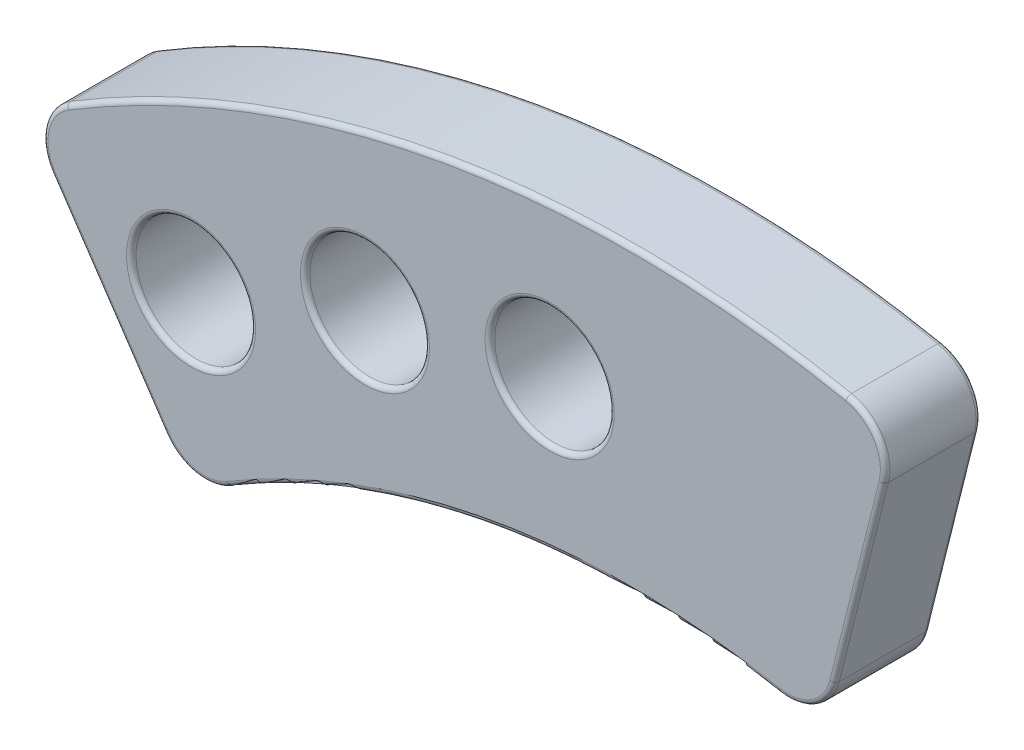
ISO-10303-21;
HEADER;
FILE_DESCRIPTION(('STEP AP214'),'2;1');
FILE_NAME('part.step','',(''),(''),'','','');
FILE_SCHEMA(('AUTOMOTIVE_DESIGN { 1 0 10303 214 1 1 1 1 }'));
ENDSEC;
DATA;
#1=APPLICATION_CONTEXT('core data for automotive mechanical design processes');
#2=APPLICATION_PROTOCOL_DEFINITION('international standard','automotive_design',2000,#1);
#3=PRODUCT_CONTEXT('',#1,'mechanical');
#4=PRODUCT('Part','Part','',(#3));
#5=PRODUCT_RELATED_PRODUCT_CATEGORY('part','',(#4));
#6=PRODUCT_DEFINITION_FORMATION('','',#4);
#7=PRODUCT_DEFINITION_CONTEXT('part definition',#1,'design');
#8=PRODUCT_DEFINITION('design','',#6,#7);
#9=PRODUCT_DEFINITION_SHAPE('','',#8);
#10=(LENGTH_UNIT() NAMED_UNIT(*) SI_UNIT(.MILLI.,.METRE.));
#11=(NAMED_UNIT(*) PLANE_ANGLE_UNIT() SI_UNIT($,.RADIAN.));
#12=(NAMED_UNIT(*) SI_UNIT($,.STERADIAN.) SOLID_ANGLE_UNIT());
#13=UNCERTAINTY_MEASURE_WITH_UNIT(LENGTH_MEASURE(1.E-05),#10,'distance_accuracy_value','');
#14=(GEOMETRIC_REPRESENTATION_CONTEXT(3) GLOBAL_UNCERTAINTY_ASSIGNED_CONTEXT((#13)) GLOBAL_UNIT_ASSIGNED_CONTEXT((#10,
#11,#12)) REPRESENTATION_CONTEXT('',''));
#15=CARTESIAN_POINT('',(0.,0.,0.));
#16=DIRECTION('',(0.,0.,1.));
#17=DIRECTION('',(1.,0.,0.));
#18=AXIS2_PLACEMENT_3D('',#15,#16,#17);
#19=CARTESIAN_POINT('',(-0.00224632428349675,0.000561633652876828,4.));
#20=DIRECTION('',(0.970137156618253,-0.242556998144047,0.));
#21=DIRECTION('',(0.242556998144047,0.970137156618253,0.));
#22=AXIS2_PLACEMENT_3D('',#19,#20,#21);
#23=PLANE('',#22);
#24=DIRECTION('',(0.,0.,1.));
#25=VECTOR('',#24,1.);
#26=CARTESIAN_POINT('',(10.5367100920138,42.1524405308287,4.));
#27=LINE('',#26,#25);
#28=CARTESIAN_POINT('',(10.5367100920138,42.1524405308287,0.2));
#29=VERTEX_POINT('',#28);
#30=CARTESIAN_POINT('',(10.5367100920138,42.1524405308287,3.8));
#31=VERTEX_POINT('',#30);
#32=EDGE_CURVE('E318',#29,#31,#27,.T.);
#33=ORIENTED_EDGE('',*,*,#32,.T.);
#34=DIRECTION('',(-0.242556998144047,-0.970137156618253,0.));
#35=VECTOR('',#34,1.);
#36=CARTESIAN_POINT('',(-0.00224632428349675,0.000561633652876828,3.8));
#37=LINE('',#36,#35);
#38=CARTESIAN_POINT('',(8.47203942693548,33.8945310757377,3.8));
#39=VERTEX_POINT('',#38);
#40=EDGE_CURVE('E195',#31,#39,#37,.T.);
#41=ORIENTED_EDGE('',*,*,#40,.T.);
#42=DIRECTION('',(0.,0.,-1.));
#43=VECTOR('',#42,1.);
#44=CARTESIAN_POINT('',(8.47203942693548,33.8945310757377,4.));
#45=LINE('',#44,#43);
#46=CARTESIAN_POINT('',(8.47203942693548,33.8945310757377,0.2));
#47=VERTEX_POINT('',#46);
#48=EDGE_CURVE('E326',#39,#47,#45,.T.);
#49=ORIENTED_EDGE('',*,*,#48,.T.);
#50=DIRECTION('',(-0.242556998144047,-0.970137156618253,0.));
#51=VECTOR('',#50,1.);
#52=CARTESIAN_POINT('',(10.5367100920138,42.1524405308287,0.2));
#53=LINE('',#52,#51);
#54=EDGE_CURVE('E193',#47,#29,#53,.F.);
#55=ORIENTED_EDGE('',*,*,#54,.T.);
#56=EDGE_LOOP('',(#33,#41,#49,#55));
#57=FACE_BOUND('',#56,.T.);
#58=ADVANCED_FACE('F37',(#57),#23,.T.);
#59=CARTESIAN_POINT('',(0.,0.,4.));
#60=DIRECTION('',(0.,0.,-1.));
#61=DIRECTION('',(-1.,0.,0.));
#62=AXIS2_PLACEMENT_3D('',#59,#60,#61);
#63=CYLINDRICAL_SURFACE('',#62,45.4955142991953);
#64=DIRECTION('',(0.,0.,-1.));
#65=VECTOR('',#64,1.);
#66=CARTESIAN_POINT('',(-23.6671021063968,38.8549880869068,4.));
#67=LINE('',#66,#65);
#68=CARTESIAN_POINT('',(-23.6671021063968,38.8549880869068,0.2));
#69=VERTEX_POINT('',#68);
#70=CARTESIAN_POINT('',(-23.6671021063968,38.8549880869068,3.8));
#71=VERTEX_POINT('',#70);
#72=EDGE_CURVE('E310',#69,#71,#67,.F.);
#73=ORIENTED_EDGE('',*,*,#72,.T.);
#74=CARTESIAN_POINT('',(0.,0.,3.8));
#75=DIRECTION('',(0.,0.,1.));
#76=DIRECTION('',(1.,0.,0.));
#77=AXIS2_PLACEMENT_3D('',#74,#75,#76);
#78=CIRCLE('',#77,45.4955142991953);
#79=CARTESIAN_POINT('',(8.99171496640316,44.5981040326968,3.8));
#80=VERTEX_POINT('',#79);
#81=EDGE_CURVE('E187',#71,#80,#78,.F.);
#82=ORIENTED_EDGE('',*,*,#81,.T.);
#83=DIRECTION('',(0.,0.,-1.));
#84=VECTOR('',#83,1.);
#85=CARTESIAN_POINT('',(8.99171496640316,44.5981040326968,4.));
#86=LINE('',#85,#84);
#87=CARTESIAN_POINT('',(8.99171496640316,44.5981040326968,0.2));
#88=VERTEX_POINT('',#87);
#89=EDGE_CURVE('E330',#80,#88,#86,.T.);
#90=ORIENTED_EDGE('',*,*,#89,.T.);
#91=CARTESIAN_POINT('',(0.,0.,0.2));
#92=DIRECTION('',(0.,0.,1.));
#93=DIRECTION('',(1.,0.,0.));
#94=AXIS2_PLACEMENT_3D('',#91,#92,#93);
#95=CIRCLE('',#94,45.4955142991953);
#96=EDGE_CURVE('E185',#88,#69,#95,.T.);
#97=ORIENTED_EDGE('',*,*,#96,.T.);
#98=EDGE_LOOP('',(#73,#82,#90,#97));
#99=FACE_BOUND('',#98,.T.);
#100=ADVANCED_FACE('F359',(#99),#63,.T.);
#101=CARTESIAN_POINT('',(0.,0.,4.));
#102=DIRECTION('',(0.829216596767474,0.558927397472488,0.));
#103=DIRECTION('',(-0.558927397472488,0.829216596767474,0.));
#104=AXIS2_PLACEMENT_3D('',#101,#102,#103);
#105=PLANE('',#104);
#106=DIRECTION('',(0.,0.,1.));
#107=VECTOR('',#106,1.);
#108=CARTESIAN_POINT('',(-19.5274863105358,28.9706960422225,4.));
#109=LINE('',#108,#107);
#110=CARTESIAN_POINT('',(-19.5274863105358,28.9706960422225,0.2));
#111=VERTEX_POINT('',#110);
#112=CARTESIAN_POINT('',(-19.5274863105358,28.9706960422225,3.8));
#113=VERTEX_POINT('',#112);
#114=EDGE_CURVE('E315',#111,#113,#109,.T.);
#115=ORIENTED_EDGE('',*,*,#114,.T.);
#116=DIRECTION('',(0.558927397472488,-0.829216596767474,0.));
#117=VECTOR('',#116,1.);
#118=CARTESIAN_POINT('',(-24.2851205482376,36.0290533335123,3.8));
#119=LINE('',#118,#117);
#120=CARTESIAN_POINT('',(-24.2851205482376,36.0290533335122,3.8));
#121=VERTEX_POINT('',#120);
#122=EDGE_CURVE('E212',#113,#121,#119,.F.);
#123=ORIENTED_EDGE('',*,*,#122,.T.);
#124=DIRECTION('',(0.,0.,-1.));
#125=VECTOR('',#124,1.);
#126=CARTESIAN_POINT('',(-24.2851205482376,36.0290533335122,4.));
#127=LINE('',#126,#125);
#128=CARTESIAN_POINT('',(-24.2851205482376,36.0290533335122,0.2));
#129=VERTEX_POINT('',#128);
#130=EDGE_CURVE('E308',#121,#129,#127,.T.);
#131=ORIENTED_EDGE('',*,*,#130,.T.);
#132=DIRECTION('',(0.558927397472488,-0.829216596767474,0.));
#133=VECTOR('',#132,1.);
#134=CARTESIAN_POINT('',(0.,0.,0.2));
#135=LINE('',#134,#133);
#136=EDGE_CURVE('E210',#129,#111,#135,.T.);
#137=ORIENTED_EDGE('',*,*,#136,.T.);
#138=EDGE_LOOP('',(#115,#123,#131,#137));
#139=FACE_BOUND('',#138,.T.);
#140=ADVANCED_FACE('F313',(#139),#105,.F.);
#141=CARTESIAN_POINT('',(-18.4416012545147,34.6422131416891,4.));
#142=DIRECTION('',(0.,0.,-1.));
#143=DIRECTION('',(-1.,0.,0.));
#144=AXIS2_PLACEMENT_3D('',#141,#142,#143);
#145=CYLINDRICAL_SURFACE('',#144,2.5);
#146=CARTESIAN_POINT('',(-18.4416012545147,34.6422131416891,3.8));
#147=DIRECTION('',(0.,0.,1.));
#148=DIRECTION('',(1.,0.,0.));
#149=AXIS2_PLACEMENT_3D('',#146,#147,#148);
#150=CIRCLE('',#149,2.5);
#151=CARTESIAN_POINT('',(-15.9416012545147,34.6422131416891,3.8));
#152=VERTEX_POINT('',#151);
#153=EDGE_CURVE('E217',#152,#152,#150,.T.);
#154=ORIENTED_EDGE('',*,*,#153,.T.);
#155=EDGE_LOOP('',(#154));
#156=FACE_BOUND('',#155,.T.);
#157=CARTESIAN_POINT('',(-18.4416012545147,34.6422131416891,0.2));
#158=DIRECTION('',(0.,0.,1.));
#159=DIRECTION('',(1.,0.,0.));
#160=AXIS2_PLACEMENT_3D('',#157,#158,#159);
#161=CIRCLE('',#160,2.5);
#162=CARTESIAN_POINT('',(-15.9416012545147,34.6422131416891,0.2));
#163=VERTEX_POINT('',#162);
#164=EDGE_CURVE('E214',#163,#163,#161,.F.);
#165=ORIENTED_EDGE('',*,*,#164,.T.);
#166=EDGE_LOOP('',(#165));
#167=FACE_BOUND('',#166,.T.);
#168=ADVANCED_FACE('F413',(#156,#167),#145,.F.);
#169=CARTESIAN_POINT('',(-11.1648341843668,37.6234244297405,4.));
#170=DIRECTION('',(0.,0.,-1.));
#171=DIRECTION('',(-1.,0.,0.));
#172=AXIS2_PLACEMENT_3D('',#169,#170,#171);
#173=CYLINDRICAL_SURFACE('',#172,2.5);
#174=CARTESIAN_POINT('',(-11.1648341843668,37.6234244297405,3.8));
#175=DIRECTION('',(0.,0.,1.));
#176=DIRECTION('',(1.,0.,0.));
#177=AXIS2_PLACEMENT_3D('',#174,#175,#176);
#178=CIRCLE('',#177,2.5);
#179=CARTESIAN_POINT('',(-8.66483418436678,37.6234244297405,3.8));
#180=VERTEX_POINT('',#179);
#181=EDGE_CURVE('E223',#180,#180,#178,.T.);
#182=ORIENTED_EDGE('',*,*,#181,.T.);
#183=EDGE_LOOP('',(#182));
#184=FACE_BOUND('',#183,.T.);
#185=CARTESIAN_POINT('',(-11.1648341843668,37.6234244297405,0.2));
#186=DIRECTION('',(0.,0.,1.));
#187=DIRECTION('',(1.,0.,0.));
#188=AXIS2_PLACEMENT_3D('',#185,#186,#187);
#189=CIRCLE('',#188,2.5);
#190=CARTESIAN_POINT('',(-8.66483418436678,37.6234244297405,0.2));
#191=VERTEX_POINT('',#190);
#192=EDGE_CURVE('E220',#191,#191,#189,.F.);
#193=ORIENTED_EDGE('',*,*,#192,.T.);
#194=EDGE_LOOP('',(#193));
#195=FACE_BOUND('',#194,.T.);
#196=ADVANCED_FACE('F416',(#184,#195),#173,.F.);
#197=CARTESIAN_POINT('',(-3.43979242599749,39.0940330005862,4.));
#198=DIRECTION('',(0.,0.,-1.));
#199=DIRECTION('',(-1.,0.,0.));
#200=AXIS2_PLACEMENT_3D('',#197,#198,#199);
#201=CYLINDRICAL_SURFACE('',#200,2.5);
#202=CARTESIAN_POINT('',(-3.43979242599749,39.0940330005862,3.8));
#203=DIRECTION('',(0.,0.,1.));
#204=DIRECTION('',(1.,0.,0.));
#205=AXIS2_PLACEMENT_3D('',#202,#203,#204);
#206=CIRCLE('',#205,2.5);
#207=CARTESIAN_POINT('',(-0.939792425997486,39.0940330005862,3.8));
#208=VERTEX_POINT('',#207);
#209=EDGE_CURVE('E229',#208,#208,#206,.T.);
#210=ORIENTED_EDGE('',*,*,#209,.T.);
#211=EDGE_LOOP('',(#210));
#212=FACE_BOUND('',#211,.T.);
#213=CARTESIAN_POINT('',(-3.43979242599749,39.0940330005862,0.2));
#214=DIRECTION('',(0.,0.,1.));
#215=DIRECTION('',(1.,0.,0.));
#216=AXIS2_PLACEMENT_3D('',#213,#214,#215);
#217=CIRCLE('',#216,2.5);
#218=CARTESIAN_POINT('',(-0.939792425997486,39.0940330005862,0.2));
#219=VERTEX_POINT('',#218);
#220=EDGE_CURVE('E226',#219,#219,#217,.F.);
#221=ORIENTED_EDGE('',*,*,#220,.T.);
#222=EDGE_LOOP('',(#221));
#223=FACE_BOUND('',#222,.T.);
#224=ADVANCED_FACE('F420',(#212,#223),#201,.F.);
#225=CARTESIAN_POINT('',(0.,0.,4.));
#226=DIRECTION('',(0.,0.,-1.));
#227=DIRECTION('',(-1.,0.,0.));
#228=AXIS2_PLACEMENT_3D('',#225,#226,#227);
#229=CYLINDRICAL_SURFACE('',#228,32.9946274559254);
#230=DIRECTION('',(0.,0.,-1.));
#231=VECTOR('',#230,1.);
#232=CARTESIAN_POINT('',(6.15846409073906,32.4147923176808,4.));
#233=LINE('',#232,#231);
#234=CARTESIAN_POINT('',(6.15846409073906,32.4147923176808,0.2));
#235=VERTEX_POINT('',#234);
#236=CARTESIAN_POINT('',(6.15846409073906,32.4147923176808,3.8));
#237=VERTEX_POINT('',#236);
#238=EDGE_CURVE('E270',#235,#237,#233,.F.);
#239=ORIENTED_EDGE('',*,*,#238,.T.);
#240=CARTESIAN_POINT('',(0.,0.,3.8));
#241=DIRECTION('',(0.,0.,1.));
#242=DIRECTION('',(1.,0.,0.));
#243=AXIS2_PLACEMENT_3D('',#240,#241,#242);
#244=CIRCLE('',#243,32.9946274559254);
#245=CARTESIAN_POINT('',(-16.8478076049858,28.3689411127854,3.8));
#246=VERTEX_POINT('',#245);
#247=EDGE_CURVE('E204',#237,#246,#244,.T.);
#248=ORIENTED_EDGE('',*,*,#247,.T.);
#249=DIRECTION('',(0.,0.,-1.));
#250=VECTOR('',#249,1.);
#251=CARTESIAN_POINT('',(-16.8478076049858,28.3689411127854,4.));
#252=LINE('',#251,#250);
#253=CARTESIAN_POINT('',(-16.8478076049858,28.3689411127854,0.2));
#254=VERTEX_POINT('',#253);
#255=EDGE_CURVE('E316',#246,#254,#252,.T.);
#256=ORIENTED_EDGE('',*,*,#255,.T.);
#257=CARTESIAN_POINT('',(0.,0.,0.2));
#258=DIRECTION('',(0.,0.,1.));
#259=DIRECTION('',(1.,0.,0.));
#260=AXIS2_PLACEMENT_3D('',#257,#258,#259);
#261=CIRCLE('',#260,32.9946274559254);
#262=EDGE_CURVE('E202',#254,#235,#261,.F.);
#263=ORIENTED_EDGE('',*,*,#262,.T.);
#264=EDGE_LOOP('',(#239,#248,#256,#263));
#265=FACE_BOUND('',#264,.T.);
#266=ADVANCED_FACE('F389',(#265),#229,.F.);
#267=CARTESIAN_POINT('',(0.,0.,4.));
#268=DIRECTION('',(0.,0.,1.));
#269=DIRECTION('',(1.,0.,0.));
#270=AXIS2_PLACEMENT_3D('',#267,#268,#269);
#271=PLANE('',#270);
#272=CARTESIAN_POINT('',(0.,0.,4.));
#273=DIRECTION('',(0.,0.,1.));
#274=DIRECTION('',(1.,0.,0.));
#275=AXIS2_PLACEMENT_3D('',#272,#273,#274);
#276=CIRCLE('',#275,45.2955142991953);
#277=CARTESIAN_POINT('',(8.95218704764057,44.4020490821388,4.));
#278=VERTEX_POINT('',#277);
#279=CARTESIAN_POINT('',(-23.5630606312274,38.6841800910619,4.));
#280=VERTEX_POINT('',#279);
#281=EDGE_CURVE('E175',#278,#280,#276,.T.);
#282=ORIENTED_EDGE('',*,*,#281,.T.);
#283=CARTESIAN_POINT('',(-22.6266873547027,37.1469081284572,4.));
#284=DIRECTION('',(0.,0.,1.));
#285=DIRECTION('',(1.,0.,0.));
#286=AXIS2_PLACEMENT_3D('',#283,#284,#285);
#287=CIRCLE('',#286,1.8);
#288=CARTESIAN_POINT('',(-24.1192772288841,36.1408388130067,4.));
#289=VERTEX_POINT('',#288);
#290=EDGE_CURVE('E155',#280,#289,#287,.T.);
#291=ORIENTED_EDGE('',*,*,#290,.T.);
#292=DIRECTION('',(0.558927397472488,-0.829216596767474,0.));
#293=VECTOR('',#292,1.);
#294=CARTESIAN_POINT('',(-19.3616429911823,29.082481521717,4.));
#295=LINE('',#294,#293);
#296=CARTESIAN_POINT('',(-19.3616429911823,29.082481521717,4.));
#297=VERTEX_POINT('',#296);
#298=EDGE_CURVE('E163',#289,#297,#295,.T.);
#299=ORIENTED_EDGE('',*,*,#298,.T.);
#300=CARTESIAN_POINT('',(-17.8690531170008,30.0885508371674,4.));
#301=DIRECTION('',(0.,0.,1.));
#302=DIRECTION('',(1.,0.,0.));
#303=AXIS2_PLACEMENT_3D('',#300,#301,#302);
#304=CIRCLE('',#303,1.8);
#305=CARTESIAN_POINT('',(-16.9499321561873,28.5409020852236,4.));
#306=VERTEX_POINT('',#305);
#307=EDGE_CURVE('E169',#297,#306,#304,.T.);
#308=ORIENTED_EDGE('',*,*,#307,.T.);
#309=CARTESIAN_POINT('',(0.,0.,4.));
#310=DIRECTION('',(0.,0.,1.));
#311=DIRECTION('',(1.,0.,0.));
#312=AXIS2_PLACEMENT_3D('',#309,#310,#311);
#313=CIRCLE('',#312,33.1946274559254);
#314=CARTESIAN_POINT('',(6.19579419303505,32.6112775931153,4.));
#315=VERTEX_POINT('',#314);
#316=EDGE_CURVE('E342',#306,#315,#313,.F.);
#317=ORIENTED_EDGE('',*,*,#316,.T.);
#318=CARTESIAN_POINT('',(6.53176511369898,34.3796450720258,4.));
#319=DIRECTION('',(0.,0.,1.));
#320=DIRECTION('',(1.,0.,0.));
#321=AXIS2_PLACEMENT_3D('',#318,#319,#320);
#322=CIRCLE('',#321,1.8);
#323=CARTESIAN_POINT('',(8.27801199561183,33.9430424753666,4.));
#324=VERTEX_POINT('',#323);
#325=EDGE_CURVE('E344',#315,#324,#322,.T.);
#326=ORIENTED_EDGE('',*,*,#325,.T.);
#327=DIRECTION('',(-0.242556998144047,-0.970137156618253,0.));
#328=VECTOR('',#327,1.);
#329=CARTESIAN_POINT('',(-0.196273755607146,0.0490730332816859,4.));
#330=LINE('',#329,#328);
#331=CARTESIAN_POINT('',(10.3426826606902,42.2009519304575,4.));
#332=VERTEX_POINT('',#331);
#333=EDGE_CURVE('E346',#324,#332,#330,.F.);
#334=ORIENTED_EDGE('',*,*,#333,.T.);
#335=CARTESIAN_POINT('',(8.5964357787773,42.6375545271168,4.));
#336=DIRECTION('',(0.,0.,1.));
#337=DIRECTION('',(1.,0.,0.));
#338=AXIS2_PLACEMENT_3D('',#335,#336,#337);
#339=CIRCLE('',#338,1.8);
#340=EDGE_CURVE('E180',#332,#278,#339,.T.);
#341=ORIENTED_EDGE('',*,*,#340,.T.);
#342=EDGE_LOOP('',(#282,#291,#299,#308,#317,#326,#334,#341));
#343=FACE_BOUND('',#342,.T.);
#344=CARTESIAN_POINT('',(-18.4416012545147,34.6422131416891,4.));
#345=DIRECTION('',(0.,0.,1.));
#346=DIRECTION('',(1.,0.,0.));
#347=AXIS2_PLACEMENT_3D('',#344,#345,#346);
#348=CIRCLE('',#347,2.7);
#349=CARTESIAN_POINT('',(-15.7416012545147,34.6422131416891,4.));
#350=VERTEX_POINT('',#349);
#351=EDGE_CURVE('E170',#350,#350,#348,.F.);
#352=ORIENTED_EDGE('',*,*,#351,.T.);
#353=EDGE_LOOP('',(#352));
#354=FACE_BOUND('',#353,.T.);
#355=CARTESIAN_POINT('',(-11.1648341843668,37.6234244297405,4.));
#356=DIRECTION('',(0.,0.,1.));
#357=DIRECTION('',(1.,0.,0.));
#358=AXIS2_PLACEMENT_3D('',#355,#356,#357);
#359=CIRCLE('',#358,2.7);
#360=CARTESIAN_POINT('',(-8.46483418436678,37.6234244297405,4.));
#361=VERTEX_POINT('',#360);
#362=EDGE_CURVE('E336',#361,#361,#359,.F.);
#363=ORIENTED_EDGE('',*,*,#362,.T.);
#364=EDGE_LOOP('',(#363));
#365=FACE_BOUND('',#364,.T.);
#366=CARTESIAN_POINT('',(-3.43979242599749,39.0940330005862,4.));
#367=DIRECTION('',(0.,0.,1.));
#368=DIRECTION('',(1.,0.,0.));
#369=AXIS2_PLACEMENT_3D('',#366,#367,#368);
#370=CIRCLE('',#369,2.7);
#371=CARTESIAN_POINT('',(-0.739792425997486,39.0940330005862,4.));
#372=VERTEX_POINT('',#371);
#373=EDGE_CURVE('E333',#372,#372,#370,.F.);
#374=ORIENTED_EDGE('',*,*,#373,.T.);
#375=EDGE_LOOP('',(#374));
#376=FACE_BOUND('',#375,.T.);
#377=ADVANCED_FACE('F172',(#343,#354,#365,#376),#271,.T.);
#378=CARTESIAN_POINT('',(0.,0.,0.));
#379=DIRECTION('',(0.,0.,1.));
#380=DIRECTION('',(1.,0.,0.));
#381=AXIS2_PLACEMENT_3D('',#378,#379,#380);
#382=PLANE('',#381);
#383=DIRECTION('',(-0.242556998144047,-0.970137156618253,0.));
#384=VECTOR('',#383,1.);
#385=CARTESIAN_POINT('',(8.27801199561184,33.9430424753666,0.));
#386=LINE('',#385,#384);
#387=CARTESIAN_POINT('',(10.3426826606902,42.2009519304575,0.));
#388=VERTEX_POINT('',#387);
#389=CARTESIAN_POINT('',(8.27801199561183,33.9430424753666,0.));
#390=VERTEX_POINT('',#389);
#391=EDGE_CURVE('E46',#388,#390,#386,.T.);
#392=ORIENTED_EDGE('',*,*,#391,.T.);
#393=CARTESIAN_POINT('',(6.53176511369898,34.3796450720258,0.));
#394=DIRECTION('',(0.,0.,1.));
#395=DIRECTION('',(1.,0.,0.));
#396=AXIS2_PLACEMENT_3D('',#393,#394,#395);
#397=CIRCLE('',#396,1.8);
#398=CARTESIAN_POINT('',(6.19579419303505,32.6112775931153,0.));
#399=VERTEX_POINT('',#398);
#400=EDGE_CURVE('E11',#390,#399,#397,.F.);
#401=ORIENTED_EDGE('',*,*,#400,.T.);
#402=CARTESIAN_POINT('',(0.,0.,0.));
#403=DIRECTION('',(0.,0.,1.));
#404=DIRECTION('',(1.,0.,0.));
#405=AXIS2_PLACEMENT_3D('',#402,#403,#404);
#406=CIRCLE('',#405,33.1946274559254);
#407=CARTESIAN_POINT('',(-16.9499321561873,28.5409020852236,0.));
#408=VERTEX_POINT('',#407);
#409=EDGE_CURVE('E241',#399,#408,#406,.T.);
#410=ORIENTED_EDGE('',*,*,#409,.T.);
#411=CARTESIAN_POINT('',(-17.8690531170008,30.0885508371674,0.));
#412=DIRECTION('',(0.,0.,1.));
#413=DIRECTION('',(1.,0.,0.));
#414=AXIS2_PLACEMENT_3D('',#411,#412,#413);
#415=CIRCLE('',#414,1.8);
#416=CARTESIAN_POINT('',(-19.3616429911823,29.082481521717,0.));
#417=VERTEX_POINT('',#416);
#418=EDGE_CURVE('E243',#408,#417,#415,.F.);
#419=ORIENTED_EDGE('',*,*,#418,.T.);
#420=DIRECTION('',(0.558927397472488,-0.829216596767474,0.));
#421=VECTOR('',#420,1.);
#422=CARTESIAN_POINT('',(0.1658433193535,0.111785479494501,0.));
#423=LINE('',#422,#421);
#424=CARTESIAN_POINT('',(-24.1192772288841,36.1408388130067,0.));
#425=VERTEX_POINT('',#424);
#426=EDGE_CURVE('E245',#417,#425,#423,.F.);
#427=ORIENTED_EDGE('',*,*,#426,.T.);
#428=CARTESIAN_POINT('',(-22.6266873547027,37.1469081284572,0.));
#429=DIRECTION('',(0.,0.,1.));
#430=DIRECTION('',(1.,0.,0.));
#431=AXIS2_PLACEMENT_3D('',#428,#429,#430);
#432=CIRCLE('',#431,1.8);
#433=CARTESIAN_POINT('',(-23.5630606312274,38.6841800910619,0.));
#434=VERTEX_POINT('',#433);
#435=EDGE_CURVE('E247',#425,#434,#432,.F.);
#436=ORIENTED_EDGE('',*,*,#435,.T.);
#437=CARTESIAN_POINT('',(0.,0.,0.));
#438=DIRECTION('',(0.,0.,1.));
#439=DIRECTION('',(1.,0.,0.));
#440=AXIS2_PLACEMENT_3D('',#437,#438,#439);
#441=CIRCLE('',#440,45.2955142991953);
#442=CARTESIAN_POINT('',(8.95218704764057,44.4020490821388,0.));
#443=VERTEX_POINT('',#442);
#444=EDGE_CURVE('E249',#434,#443,#441,.F.);
#445=ORIENTED_EDGE('',*,*,#444,.T.);
#446=CARTESIAN_POINT('',(8.5964357787773,42.6375545271168,0.));
#447=DIRECTION('',(0.,0.,1.));
#448=DIRECTION('',(1.,0.,0.));
#449=AXIS2_PLACEMENT_3D('',#446,#447,#448);
#450=CIRCLE('',#449,1.8);
#451=EDGE_CURVE('E57',#443,#388,#450,.F.);
#452=ORIENTED_EDGE('',*,*,#451,.T.);
#453=EDGE_LOOP('',(#392,#401,#410,#419,#427,#436,#445,#452));
#454=FACE_BOUND('',#453,.T.);
#455=CARTESIAN_POINT('',(-18.4416012545147,34.6422131416891,0.));
#456=DIRECTION('',(0.,0.,1.));
#457=DIRECTION('',(1.,0.,0.));
#458=AXIS2_PLACEMENT_3D('',#455,#456,#457);
#459=CIRCLE('',#458,2.7);
#460=CARTESIAN_POINT('',(-15.7416012545147,34.6422131416891,0.));
#461=VERTEX_POINT('',#460);
#462=EDGE_CURVE('E238',#461,#461,#459,.T.);
#463=ORIENTED_EDGE('',*,*,#462,.T.);
#464=EDGE_LOOP('',(#463));
#465=FACE_BOUND('',#464,.T.);
#466=CARTESIAN_POINT('',(-11.1648341843668,37.6234244297405,0.));
#467=DIRECTION('',(0.,0.,1.));
#468=DIRECTION('',(1.,0.,0.));
#469=AXIS2_PLACEMENT_3D('',#466,#467,#468);
#470=CIRCLE('',#469,2.7);
#471=CARTESIAN_POINT('',(-8.46483418436678,37.6234244297405,0.));
#472=VERTEX_POINT('',#471);
#473=EDGE_CURVE('E235',#472,#472,#470,.T.);
#474=ORIENTED_EDGE('',*,*,#473,.T.);
#475=EDGE_LOOP('',(#474));
#476=FACE_BOUND('',#475,.T.);
#477=CARTESIAN_POINT('',(-3.43979242599749,39.0940330005862,0.));
#478=DIRECTION('',(0.,0.,1.));
#479=DIRECTION('',(1.,0.,0.));
#480=AXIS2_PLACEMENT_3D('',#477,#478,#479);
#481=CIRCLE('',#480,2.7);
#482=CARTESIAN_POINT('',(-0.739792425997486,39.0940330005862,0.));
#483=VERTEX_POINT('',#482);
#484=EDGE_CURVE('E232',#483,#483,#481,.T.);
#485=ORIENTED_EDGE('',*,*,#484,.T.);
#486=EDGE_LOOP('',(#485));
#487=FACE_BOUND('',#486,.T.);
#488=ADVANCED_FACE('F375',(#454,#465,#476,#487),#382,.F.);
#489=CARTESIAN_POINT('',(-17.8690531170008,30.0885508371674,4.));
#490=DIRECTION('',(0.,0.,-1.));
#491=DIRECTION('',(-1.,0.,0.));
#492=AXIS2_PLACEMENT_3D('',#489,#490,#491);
#493=CYLINDRICAL_SURFACE('',#492,2.);
#494=ORIENTED_EDGE('',*,*,#255,.F.);
#495=CARTESIAN_POINT('',(-17.8690531170008,30.0885508371674,3.8));
#496=DIRECTION('',(0.,0.,1.));
#497=DIRECTION('',(1.,0.,0.));
#498=AXIS2_PLACEMENT_3D('',#495,#496,#497);
#499=CIRCLE('',#498,2.);
#500=EDGE_CURVE('E208',#246,#113,#499,.F.);
#501=ORIENTED_EDGE('',*,*,#500,.T.);
#502=ORIENTED_EDGE('',*,*,#114,.F.);
#503=CARTESIAN_POINT('',(-17.8690531170008,30.0885508371674,0.2));
#504=DIRECTION('',(0.,0.,1.));
#505=DIRECTION('',(1.,0.,0.));
#506=AXIS2_PLACEMENT_3D('',#503,#504,#505);
#507=CIRCLE('',#506,2.);
#508=EDGE_CURVE('E206',#111,#254,#507,.T.);
#509=ORIENTED_EDGE('',*,*,#508,.T.);
#510=EDGE_LOOP('',(#494,#501,#502,#509));
#511=FACE_BOUND('',#510,.T.);
#512=ADVANCED_FACE('F425',(#511),#493,.T.);
#513=CARTESIAN_POINT('',(6.53176511369898,34.3796450720258,4.));
#514=DIRECTION('',(0.,0.,-1.));
#515=DIRECTION('',(-1.,0.,0.));
#516=AXIS2_PLACEMENT_3D('',#513,#514,#515);
#517=CYLINDRICAL_SURFACE('',#516,2.);
#518=ORIENTED_EDGE('',*,*,#48,.F.);
#519=CARTESIAN_POINT('',(6.53176511369898,34.3796450720258,3.8));
#520=DIRECTION('',(0.,0.,1.));
#521=DIRECTION('',(1.,0.,0.));
#522=AXIS2_PLACEMENT_3D('',#519,#520,#521);
#523=CIRCLE('',#522,2.);
#524=EDGE_CURVE('E200',#39,#237,#523,.F.);
#525=ORIENTED_EDGE('',*,*,#524,.T.);
#526=ORIENTED_EDGE('',*,*,#238,.F.);
#527=CARTESIAN_POINT('',(6.53176511369898,34.3796450720258,0.2));
#528=DIRECTION('',(0.,0.,1.));
#529=DIRECTION('',(1.,0.,0.));
#530=AXIS2_PLACEMENT_3D('',#527,#528,#529);
#531=CIRCLE('',#530,2.);
#532=EDGE_CURVE('E197',#235,#47,#531,.T.);
#533=ORIENTED_EDGE('',*,*,#532,.T.);
#534=EDGE_LOOP('',(#518,#525,#526,#533));
#535=FACE_BOUND('',#534,.T.);
#536=ADVANCED_FACE('F394',(#535),#517,.T.);
#537=CARTESIAN_POINT('',(8.5964357787773,42.6375545271168,4.));
#538=DIRECTION('',(0.,0.,-1.));
#539=DIRECTION('',(-1.,0.,0.));
#540=AXIS2_PLACEMENT_3D('',#537,#538,#539);
#541=CYLINDRICAL_SURFACE('',#540,2.);
#542=ORIENTED_EDGE('',*,*,#89,.F.);
#543=CARTESIAN_POINT('',(8.5964357787773,42.6375545271168,3.8));
#544=DIRECTION('',(0.,0.,1.));
#545=DIRECTION('',(1.,0.,0.));
#546=AXIS2_PLACEMENT_3D('',#543,#544,#545);
#547=CIRCLE('',#546,2.);
#548=EDGE_CURVE('E191',#80,#31,#547,.F.);
#549=ORIENTED_EDGE('',*,*,#548,.T.);
#550=ORIENTED_EDGE('',*,*,#32,.F.);
#551=CARTESIAN_POINT('',(8.5964357787773,42.6375545271168,0.2));
#552=DIRECTION('',(0.,0.,1.));
#553=DIRECTION('',(1.,0.,0.));
#554=AXIS2_PLACEMENT_3D('',#551,#552,#553);
#555=CIRCLE('',#554,2.);
#556=EDGE_CURVE('E189',#29,#88,#555,.T.);
#557=ORIENTED_EDGE('',*,*,#556,.T.);
#558=EDGE_LOOP('',(#542,#549,#550,#557));
#559=FACE_BOUND('',#558,.T.);
#560=ADVANCED_FACE('F361',(#559),#541,.T.);
#561=CARTESIAN_POINT('',(-22.6266873547027,37.1469081284572,4.));
#562=DIRECTION('',(0.,0.,-1.));
#563=DIRECTION('',(-1.,0.,0.));
#564=AXIS2_PLACEMENT_3D('',#561,#562,#563);
#565=CYLINDRICAL_SURFACE('',#564,2.);
#566=ORIENTED_EDGE('',*,*,#130,.F.);
#567=CARTESIAN_POINT('',(-22.6266873547027,37.1469081284572,3.8));
#568=DIRECTION('',(0.,0.,1.));
#569=DIRECTION('',(1.,0.,0.));
#570=AXIS2_PLACEMENT_3D('',#567,#568,#569);
#571=CIRCLE('',#570,2.);
#572=EDGE_CURVE('E157',#121,#71,#571,.F.);
#573=ORIENTED_EDGE('',*,*,#572,.T.);
#574=ORIENTED_EDGE('',*,*,#72,.F.);
#575=CARTESIAN_POINT('',(-22.6266873547027,37.1469081284572,0.2));
#576=DIRECTION('',(0.,0.,1.));
#577=DIRECTION('',(1.,0.,0.));
#578=AXIS2_PLACEMENT_3D('',#575,#576,#577);
#579=CIRCLE('',#578,2.);
#580=EDGE_CURVE('E177',#69,#129,#579,.T.);
#581=ORIENTED_EDGE('',*,*,#580,.T.);
#582=EDGE_LOOP('',(#566,#573,#574,#581));
#583=FACE_BOUND('',#582,.T.);
#584=ADVANCED_FACE('F307',(#583),#565,.T.);
#585=CARTESIAN_POINT('',(6.53176511369898,34.3796450720258,3.8));
#586=DIRECTION('',(0.,0.,1.));
#587=DIRECTION('',(1.,0.,0.));
#588=AXIS2_PLACEMENT_3D('',#585,#586,#587);
#589=TOROIDAL_SURFACE('',#588,1.8,0.2);
#590=CARTESIAN_POINT('',(6.19579419303506,32.6112775931154,3.8));
#591=DIRECTION('',(-0.982426377172493,0.186650511479958,0.));
#592=DIRECTION('',(-0.186650511479958,-0.982426377172493,0.));
#593=AXIS2_PLACEMENT_3D('',#590,#591,#592);
#594=CIRCLE('',#593,0.2);
#595=EDGE_CURVE('E264',#237,#315,#594,.T.);
#596=ORIENTED_EDGE('',*,*,#595,.F.);
#597=ORIENTED_EDGE('',*,*,#524,.F.);
#598=CARTESIAN_POINT('',(8.27801199561183,33.9430424753666,3.8));
#599=DIRECTION('',(0.242556998144052,0.970137156618252,0.));
#600=DIRECTION('',(-0.970137156618252,0.242556998144052,0.));
#601=AXIS2_PLACEMENT_3D('',#598,#599,#600);
#602=CIRCLE('',#601,0.2);
#603=EDGE_CURVE('E267',#324,#39,#602,.T.);
#604=ORIENTED_EDGE('',*,*,#603,.F.);
#605=ORIENTED_EDGE('',*,*,#325,.F.);
#606=EDGE_LOOP('',(#596,#597,#604,#605));
#607=FACE_BOUND('',#606,.T.);
#608=ADVANCED_FACE('F398',(#607),#589,.T.);
#609=CARTESIAN_POINT('',(-0.196273755607147,0.0490730332816862,3.8));
#610=DIRECTION('',(-0.242556998144047,-0.970137156618253,0.));
#611=DIRECTION('',(0.970137156618253,-0.242556998144047,0.));
#612=AXIS2_PLACEMENT_3D('',#609,#610,#611);
#613=CYLINDRICAL_SURFACE('',#612,0.2);
#614=ORIENTED_EDGE('',*,*,#603,.T.);
#615=ORIENTED_EDGE('',*,*,#40,.F.);
#616=CARTESIAN_POINT('',(10.3426826606902,42.2009519304575,3.8));
#617=DIRECTION('',(0.242556998144052,0.970137156618252,0.));
#618=DIRECTION('',(-0.970137156618252,0.242556998144052,0.));
#619=AXIS2_PLACEMENT_3D('',#616,#617,#618);
#620=CIRCLE('',#619,0.2);
#621=EDGE_CURVE('E261',#332,#31,#620,.T.);
#622=ORIENTED_EDGE('',*,*,#621,.F.);
#623=ORIENTED_EDGE('',*,*,#333,.F.);
#624=EDGE_LOOP('',(#614,#615,#622,#623));
#625=FACE_BOUND('',#624,.T.);
#626=ADVANCED_FACE('F403',(#625),#613,.T.);
#627=CARTESIAN_POINT('',(0.,0.,3.8));
#628=DIRECTION('',(0.,0.,1.));
#629=DIRECTION('',(1.,0.,0.));
#630=AXIS2_PLACEMENT_3D('',#627,#628,#629);
#631=TOROIDAL_SURFACE('',#630,33.1946274559254,0.2);
#632=ORIENTED_EDGE('',*,*,#595,.T.);
#633=ORIENTED_EDGE('',*,*,#316,.F.);
#634=CARTESIAN_POINT('',(-16.9499321561873,28.5409020852236,3.8));
#635=DIRECTION('',(-0.859804862191004,-0.510622756007513,0.));
#636=DIRECTION('',(0.510622756007513,-0.859804862191004,0.));
#637=AXIS2_PLACEMENT_3D('',#634,#635,#636);
#638=CIRCLE('',#637,0.2);
#639=EDGE_CURVE('E258',#246,#306,#638,.T.);
#640=ORIENTED_EDGE('',*,*,#639,.F.);
#641=ORIENTED_EDGE('',*,*,#247,.F.);
#642=EDGE_LOOP('',(#632,#633,#640,#641));
#643=FACE_BOUND('',#642,.T.);
#644=ADVANCED_FACE('F448',(#643),#631,.T.);
#645=CARTESIAN_POINT('',(8.5964357787773,42.6375545271168,3.8));
#646=DIRECTION('',(0.,0.,1.));
#647=DIRECTION('',(1.,0.,0.));
#648=AXIS2_PLACEMENT_3D('',#645,#646,#647);
#649=TOROIDAL_SURFACE('',#648,1.8,0.2);
#650=ORIENTED_EDGE('',*,*,#621,.T.);
#651=ORIENTED_EDGE('',*,*,#548,.F.);
#652=CARTESIAN_POINT('',(8.95218704764057,44.4020490821388,3.8));
#653=DIRECTION('',(-0.980274752789981,0.197639593812932,0.));
#654=DIRECTION('',(-0.197639593812932,-0.980274752789982,0.));
#655=AXIS2_PLACEMENT_3D('',#652,#653,#654);
#656=CIRCLE('',#655,0.2);
#657=EDGE_CURVE('E255',#278,#80,#656,.T.);
#658=ORIENTED_EDGE('',*,*,#657,.F.);
#659=ORIENTED_EDGE('',*,*,#340,.F.);
#660=EDGE_LOOP('',(#650,#651,#658,#659));
#661=FACE_BOUND('',#660,.T.);
#662=ADVANCED_FACE('F353',(#661),#649,.T.);
#663=CARTESIAN_POINT('',(-17.8690531170008,30.0885508371674,3.8));
#664=DIRECTION('',(0.,0.,1.));
#665=DIRECTION('',(1.,0.,0.));
#666=AXIS2_PLACEMENT_3D('',#663,#664,#665);
#667=TOROIDAL_SURFACE('',#666,1.8,0.2);
#668=ORIENTED_EDGE('',*,*,#639,.T.);
#669=ORIENTED_EDGE('',*,*,#307,.F.);
#670=CARTESIAN_POINT('',(-19.3616429911823,29.082481521717,3.8));
#671=DIRECTION('',(-0.558927397472496,0.829216596767469,0.));
#672=DIRECTION('',(-0.829216596767468,-0.558927397472496,0.));
#673=AXIS2_PLACEMENT_3D('',#670,#671,#672);
#674=CIRCLE('',#673,0.2);
#675=EDGE_CURVE('E166',#113,#297,#674,.T.);
#676=ORIENTED_EDGE('',*,*,#675,.F.);
#677=ORIENTED_EDGE('',*,*,#500,.F.);
#678=EDGE_LOOP('',(#668,#669,#676,#677));
#679=FACE_BOUND('',#678,.T.);
#680=ADVANCED_FACE('F442',(#679),#667,.T.);
#681=CARTESIAN_POINT('',(0.,0.,3.8));
#682=DIRECTION('',(0.,0.,1.));
#683=DIRECTION('',(1.,0.,0.));
#684=AXIS2_PLACEMENT_3D('',#681,#682,#683);
#685=TOROIDAL_SURFACE('',#684,45.2955142991953,0.2);
#686=ORIENTED_EDGE('',*,*,#657,.T.);
#687=ORIENTED_EDGE('',*,*,#81,.F.);
#688=CARTESIAN_POINT('',(-23.5630606312274,38.6841800910619,3.8));
#689=DIRECTION('',(-0.854039979224801,-0.520207375847076,0.));
#690=DIRECTION('',(0.520207375847076,-0.854039979224801,0.));
#691=AXIS2_PLACEMENT_3D('',#688,#689,#690);
#692=CIRCLE('',#691,0.2);
#693=EDGE_CURVE('E160',#280,#71,#692,.T.);
#694=ORIENTED_EDGE('',*,*,#693,.F.);
#695=ORIENTED_EDGE('',*,*,#281,.F.);
#696=EDGE_LOOP('',(#686,#687,#694,#695));
#697=FACE_BOUND('',#696,.T.);
#698=ADVANCED_FACE('F356',(#697),#685,.T.);
#699=CARTESIAN_POINT('',(0.165843319353501,0.111785479494501,3.8));
#700=DIRECTION('',(-0.558927397472488,0.829216596767474,0.));
#701=DIRECTION('',(-0.829216596767474,-0.558927397472488,0.));
#702=AXIS2_PLACEMENT_3D('',#699,#700,#701);
#703=CYLINDRICAL_SURFACE('',#702,0.2);
#704=ORIENTED_EDGE('',*,*,#675,.T.);
#705=ORIENTED_EDGE('',*,*,#298,.F.);
#706=CARTESIAN_POINT('',(-24.1192772288841,36.1408388130067,3.8));
#707=DIRECTION('',(-0.558927397472484,0.829216596767477,0.));
#708=DIRECTION('',(-0.829216596767477,-0.558927397472484,0.));
#709=AXIS2_PLACEMENT_3D('',#706,#707,#708);
#710=CIRCLE('',#709,0.2);
#711=EDGE_CURVE('E151',#121,#289,#710,.T.);
#712=ORIENTED_EDGE('',*,*,#711,.F.);
#713=ORIENTED_EDGE('',*,*,#122,.F.);
#714=EDGE_LOOP('',(#704,#705,#712,#713));
#715=FACE_BOUND('',#714,.T.);
#716=ADVANCED_FACE('F164',(#715),#703,.T.);
#717=CARTESIAN_POINT('',(-22.6266873547027,37.1469081284572,3.8));
#718=DIRECTION('',(0.,0.,1.));
#719=DIRECTION('',(1.,0.,0.));
#720=AXIS2_PLACEMENT_3D('',#717,#718,#719);
#721=TOROIDAL_SURFACE('',#720,1.8,0.2);
#722=ORIENTED_EDGE('',*,*,#693,.T.);
#723=ORIENTED_EDGE('',*,*,#572,.F.);
#724=ORIENTED_EDGE('',*,*,#711,.T.);
#725=ORIENTED_EDGE('',*,*,#290,.F.);
#726=EDGE_LOOP('',(#722,#723,#724,#725));
#727=FACE_BOUND('',#726,.T.);
#728=ADVANCED_FACE('F153',(#727),#721,.T.);
#729=CARTESIAN_POINT('',(-18.4416012545147,34.6422131416891,3.8));
#730=DIRECTION('',(0.,0.,1.));
#731=DIRECTION('',(1.,0.,0.));
#732=AXIS2_PLACEMENT_3D('',#729,#730,#731);
#733=TOROIDAL_SURFACE('',#732,2.7,0.2);
#734=ORIENTED_EDGE('',*,*,#351,.F.);
#735=EDGE_LOOP('',(#734));
#736=FACE_BOUND('',#735,.T.);
#737=ORIENTED_EDGE('',*,*,#153,.F.);
#738=EDGE_LOOP('',(#737));
#739=FACE_BOUND('',#738,.T.);
#740=ADVANCED_FACE('F437',(#736,#739),#733,.T.);
#741=CARTESIAN_POINT('',(-11.1648341843668,37.6234244297405,3.8));
#742=DIRECTION('',(0.,0.,1.));
#743=DIRECTION('',(1.,0.,0.));
#744=AXIS2_PLACEMENT_3D('',#741,#742,#743);
#745=TOROIDAL_SURFACE('',#744,2.7,0.2);
#746=ORIENTED_EDGE('',*,*,#362,.F.);
#747=EDGE_LOOP('',(#746));
#748=FACE_BOUND('',#747,.T.);
#749=ORIENTED_EDGE('',*,*,#181,.F.);
#750=EDGE_LOOP('',(#749));
#751=FACE_BOUND('',#750,.T.);
#752=ADVANCED_FACE('F458',(#748,#751),#745,.T.);
#753=CARTESIAN_POINT('',(-3.43979242599749,39.0940330005862,3.8));
#754=DIRECTION('',(0.,0.,1.));
#755=DIRECTION('',(1.,0.,0.));
#756=AXIS2_PLACEMENT_3D('',#753,#754,#755);
#757=TOROIDAL_SURFACE('',#756,2.7,0.2);
#758=ORIENTED_EDGE('',*,*,#373,.F.);
#759=EDGE_LOOP('',(#758));
#760=FACE_BOUND('',#759,.T.);
#761=ORIENTED_EDGE('',*,*,#209,.F.);
#762=EDGE_LOOP('',(#761));
#763=FACE_BOUND('',#762,.T.);
#764=ADVANCED_FACE('F462',(#760,#763),#757,.T.);
#765=CARTESIAN_POINT('',(-22.6266873547027,37.1469081284572,0.2));
#766=DIRECTION('',(0.,0.,1.));
#767=DIRECTION('',(1.,0.,0.));
#768=AXIS2_PLACEMENT_3D('',#765,#766,#767);
#769=TOROIDAL_SURFACE('',#768,1.8,0.2);
#770=CARTESIAN_POINT('',(-24.1192772288841,36.1408388130067,0.2));
#771=DIRECTION('',(0.558927397472484,-0.829216596767477,0.));
#772=DIRECTION('',(0.829216596767477,0.558927397472484,0.));
#773=AXIS2_PLACEMENT_3D('',#770,#771,#772);
#774=CIRCLE('',#773,0.2);
#775=EDGE_CURVE('E286',#129,#425,#774,.T.);
#776=ORIENTED_EDGE('',*,*,#775,.F.);
#777=ORIENTED_EDGE('',*,*,#580,.F.);
#778=CARTESIAN_POINT('',(-23.5630606312274,38.6841800910619,0.2));
#779=DIRECTION('',(0.854039979224809,0.520207375847064,0.));
#780=DIRECTION('',(-0.520207375847064,0.854039979224809,0.));
#781=AXIS2_PLACEMENT_3D('',#778,#779,#780);
#782=CIRCLE('',#781,0.2);
#783=EDGE_CURVE('E41',#434,#69,#782,.T.);
#784=ORIENTED_EDGE('',*,*,#783,.F.);
#785=ORIENTED_EDGE('',*,*,#435,.F.);
#786=EDGE_LOOP('',(#776,#777,#784,#785));
#787=FACE_BOUND('',#786,.T.);
#788=ADVANCED_FACE('F302',(#787),#769,.T.);
#789=CARTESIAN_POINT('',(0.,0.,0.2));
#790=DIRECTION('',(0.,0.,1.));
#791=DIRECTION('',(1.,0.,0.));
#792=AXIS2_PLACEMENT_3D('',#789,#790,#791);
#793=TOROIDAL_SURFACE('',#792,45.2955142991953,0.2);
#794=ORIENTED_EDGE('',*,*,#783,.T.);
#795=ORIENTED_EDGE('',*,*,#96,.F.);
#796=CARTESIAN_POINT('',(8.95218704764057,44.4020490821388,0.2));
#797=DIRECTION('',(0.980274752789981,-0.197639593812932,0.));
#798=DIRECTION('',(0.197639593812932,0.980274752789981,0.));
#799=AXIS2_PLACEMENT_3D('',#796,#797,#798);
#800=CIRCLE('',#799,0.2);
#801=EDGE_CURVE('E284',#443,#88,#800,.T.);
#802=ORIENTED_EDGE('',*,*,#801,.F.);
#803=ORIENTED_EDGE('',*,*,#444,.F.);
#804=EDGE_LOOP('',(#794,#795,#802,#803));
#805=FACE_BOUND('',#804,.T.);
#806=ADVANCED_FACE('F297',(#805),#793,.T.);
#807=CARTESIAN_POINT('',(0.165843319353501,0.111785479494501,0.2));
#808=DIRECTION('',(0.558927397472488,-0.829216596767474,0.));
#809=DIRECTION('',(0.829216596767474,0.558927397472488,0.));
#810=AXIS2_PLACEMENT_3D('',#807,#808,#809);
#811=CYLINDRICAL_SURFACE('',#810,0.2);
#812=ORIENTED_EDGE('',*,*,#775,.T.);
#813=ORIENTED_EDGE('',*,*,#426,.F.);
#814=CARTESIAN_POINT('',(-19.3616429911823,29.082481521717,0.2));
#815=DIRECTION('',(0.558927397472484,-0.829216596767477,0.));
#816=DIRECTION('',(0.829216596767477,0.558927397472484,0.));
#817=AXIS2_PLACEMENT_3D('',#814,#815,#816);
#818=CIRCLE('',#817,0.2);
#819=EDGE_CURVE('E281',#111,#417,#818,.T.);
#820=ORIENTED_EDGE('',*,*,#819,.F.);
#821=ORIENTED_EDGE('',*,*,#136,.F.);
#822=EDGE_LOOP('',(#812,#813,#820,#821));
#823=FACE_BOUND('',#822,.T.);
#824=ADVANCED_FACE('F478',(#823),#811,.T.);
#825=CARTESIAN_POINT('',(8.5964357787773,42.6375545271168,0.2));
#826=DIRECTION('',(0.,0.,1.));
#827=DIRECTION('',(1.,0.,0.));
#828=AXIS2_PLACEMENT_3D('',#825,#826,#827);
#829=TOROIDAL_SURFACE('',#828,1.8,0.2);
#830=ORIENTED_EDGE('',*,*,#801,.T.);
#831=ORIENTED_EDGE('',*,*,#556,.F.);
#832=CARTESIAN_POINT('',(10.3426826606902,42.2009519304575,0.2));
#833=DIRECTION('',(-0.242556998144052,-0.970137156618252,0.));
#834=DIRECTION('',(0.970137156618252,-0.242556998144052,0.));
#835=AXIS2_PLACEMENT_3D('',#832,#833,#834);
#836=CIRCLE('',#835,0.2);
#837=EDGE_CURVE('E278',#388,#29,#836,.T.);
#838=ORIENTED_EDGE('',*,*,#837,.F.);
#839=ORIENTED_EDGE('',*,*,#451,.F.);
#840=EDGE_LOOP('',(#830,#831,#838,#839));
#841=FACE_BOUND('',#840,.T.);
#842=ADVANCED_FACE('F365',(#841),#829,.T.);
#843=CARTESIAN_POINT('',(-17.8690531170008,30.0885508371674,0.2));
#844=DIRECTION('',(0.,0.,1.));
#845=DIRECTION('',(1.,0.,0.));
#846=AXIS2_PLACEMENT_3D('',#843,#844,#845);
#847=TOROIDAL_SURFACE('',#846,1.8,0.2);
#848=ORIENTED_EDGE('',*,*,#819,.T.);
#849=ORIENTED_EDGE('',*,*,#418,.F.);
#850=CARTESIAN_POINT('',(-16.9499321561873,28.5409020852236,0.2));
#851=DIRECTION('',(0.859804862191004,0.510622756007513,0.));
#852=DIRECTION('',(-0.510622756007513,0.859804862191004,0.));
#853=AXIS2_PLACEMENT_3D('',#850,#851,#852);
#854=CIRCLE('',#853,0.2);
#855=EDGE_CURVE('E275',#254,#408,#854,.T.);
#856=ORIENTED_EDGE('',*,*,#855,.F.);
#857=ORIENTED_EDGE('',*,*,#508,.F.);
#858=EDGE_LOOP('',(#848,#849,#856,#857));
#859=FACE_BOUND('',#858,.T.);
#860=ADVANCED_FACE('F381',(#859),#847,.T.);
#861=CARTESIAN_POINT('',(-0.196273755607147,0.0490730332816862,0.2));
#862=DIRECTION('',(0.242556998144047,0.970137156618253,0.));
#863=DIRECTION('',(-0.970137156618253,0.242556998144047,0.));
#864=AXIS2_PLACEMENT_3D('',#861,#862,#863);
#865=CYLINDRICAL_SURFACE('',#864,0.2);
#866=ORIENTED_EDGE('',*,*,#837,.T.);
#867=ORIENTED_EDGE('',*,*,#54,.F.);
#868=CARTESIAN_POINT('',(8.27801199561183,33.9430424753666,0.2));
#869=DIRECTION('',(-0.242556998144052,-0.970137156618252,0.));
#870=DIRECTION('',(0.970137156618252,-0.242556998144052,0.));
#871=AXIS2_PLACEMENT_3D('',#868,#869,#870);
#872=CIRCLE('',#871,0.2);
#873=EDGE_CURVE('E273',#390,#47,#872,.T.);
#874=ORIENTED_EDGE('',*,*,#873,.F.);
#875=ORIENTED_EDGE('',*,*,#391,.F.);
#876=EDGE_LOOP('',(#866,#867,#874,#875));
#877=FACE_BOUND('',#876,.T.);
#878=ADVANCED_FACE('F368',(#877),#865,.T.);
#879=CARTESIAN_POINT('',(0.,0.,0.2));
#880=DIRECTION('',(0.,0.,1.));
#881=DIRECTION('',(1.,0.,0.));
#882=AXIS2_PLACEMENT_3D('',#879,#880,#881);
#883=TOROIDAL_SURFACE('',#882,33.1946274559254,0.2);
#884=ORIENTED_EDGE('',*,*,#855,.T.);
#885=ORIENTED_EDGE('',*,*,#409,.F.);
#886=CARTESIAN_POINT('',(6.19579419303505,32.6112775931153,0.2));
#887=DIRECTION('',(0.982426377172493,-0.186650511479958,0.));
#888=DIRECTION('',(0.186650511479958,0.982426377172493,0.));
#889=AXIS2_PLACEMENT_3D('',#886,#887,#888);
#890=CIRCLE('',#889,0.2);
#891=EDGE_CURVE('E271',#235,#399,#890,.T.);
#892=ORIENTED_EDGE('',*,*,#891,.F.);
#893=ORIENTED_EDGE('',*,*,#262,.F.);
#894=EDGE_LOOP('',(#884,#885,#892,#893));
#895=FACE_BOUND('',#894,.T.);
#896=ADVANCED_FACE('F385',(#895),#883,.T.);
#897=CARTESIAN_POINT('',(6.53176511369898,34.3796450720258,0.2));
#898=DIRECTION('',(0.,0.,1.));
#899=DIRECTION('',(1.,0.,0.));
#900=AXIS2_PLACEMENT_3D('',#897,#898,#899);
#901=TOROIDAL_SURFACE('',#900,1.8,0.2);
#902=ORIENTED_EDGE('',*,*,#873,.T.);
#903=ORIENTED_EDGE('',*,*,#532,.F.);
#904=ORIENTED_EDGE('',*,*,#891,.T.);
#905=ORIENTED_EDGE('',*,*,#400,.F.);
#906=EDGE_LOOP('',(#902,#903,#904,#905));
#907=FACE_BOUND('',#906,.T.);
#908=ADVANCED_FACE('F372',(#907),#901,.T.);
#909=CARTESIAN_POINT('',(-18.4416012545147,34.6422131416891,0.2));
#910=DIRECTION('',(0.,0.,1.));
#911=DIRECTION('',(1.,0.,0.));
#912=AXIS2_PLACEMENT_3D('',#909,#910,#911);
#913=TOROIDAL_SURFACE('',#912,2.7,0.2);
#914=ORIENTED_EDGE('',*,*,#164,.F.);
#915=EDGE_LOOP('',(#914));
#916=FACE_BOUND('',#915,.T.);
#917=ORIENTED_EDGE('',*,*,#462,.F.);
#918=EDGE_LOOP('',(#917));
#919=FACE_BOUND('',#918,.T.);
#920=ADVANCED_FACE('F469',(#916,#919),#913,.T.);
#921=CARTESIAN_POINT('',(-11.1648341843668,37.6234244297405,0.2));
#922=DIRECTION('',(0.,0.,1.));
#923=DIRECTION('',(1.,0.,0.));
#924=AXIS2_PLACEMENT_3D('',#921,#922,#923);
#925=TOROIDAL_SURFACE('',#924,2.7,0.2);
#926=ORIENTED_EDGE('',*,*,#192,.F.);
#927=EDGE_LOOP('',(#926));
#928=FACE_BOUND('',#927,.T.);
#929=ORIENTED_EDGE('',*,*,#473,.F.);
#930=EDGE_LOOP('',(#929));
#931=FACE_BOUND('',#930,.T.);
#932=ADVANCED_FACE('F486',(#928,#931),#925,.T.);
#933=CARTESIAN_POINT('',(-3.43979242599749,39.0940330005862,0.2));
#934=DIRECTION('',(0.,0.,1.));
#935=DIRECTION('',(1.,0.,0.));
#936=AXIS2_PLACEMENT_3D('',#933,#934,#935);
#937=TOROIDAL_SURFACE('',#936,2.7,0.2);
#938=ORIENTED_EDGE('',*,*,#220,.F.);
#939=EDGE_LOOP('',(#938));
#940=FACE_BOUND('',#939,.T.);
#941=ORIENTED_EDGE('',*,*,#484,.F.);
#942=EDGE_LOOP('',(#941));
#943=FACE_BOUND('',#942,.T.);
#944=ADVANCED_FACE('F39',(#940,#943),#937,.T.);
#945=CLOSED_SHELL('',(#58,#100,#140,#168,#196,#224,#266,#377,#488,#512,#536,#560,#584,#608,#626,
#644,#662,#680,#698,#716,#728,#740,#752,#764,#788,#806,#824,#842,#860,#878,#896,#908,#920,#932,#944));
#946=MANIFOLD_SOLID_BREP('B2',#945);
#947=ADVANCED_BREP_SHAPE_REPRESENTATION('',(#18,#946),#14);
#948=SHAPE_DEFINITION_REPRESENTATION(#9,#947);
ENDSEC;
END-ISO-10303-21;
